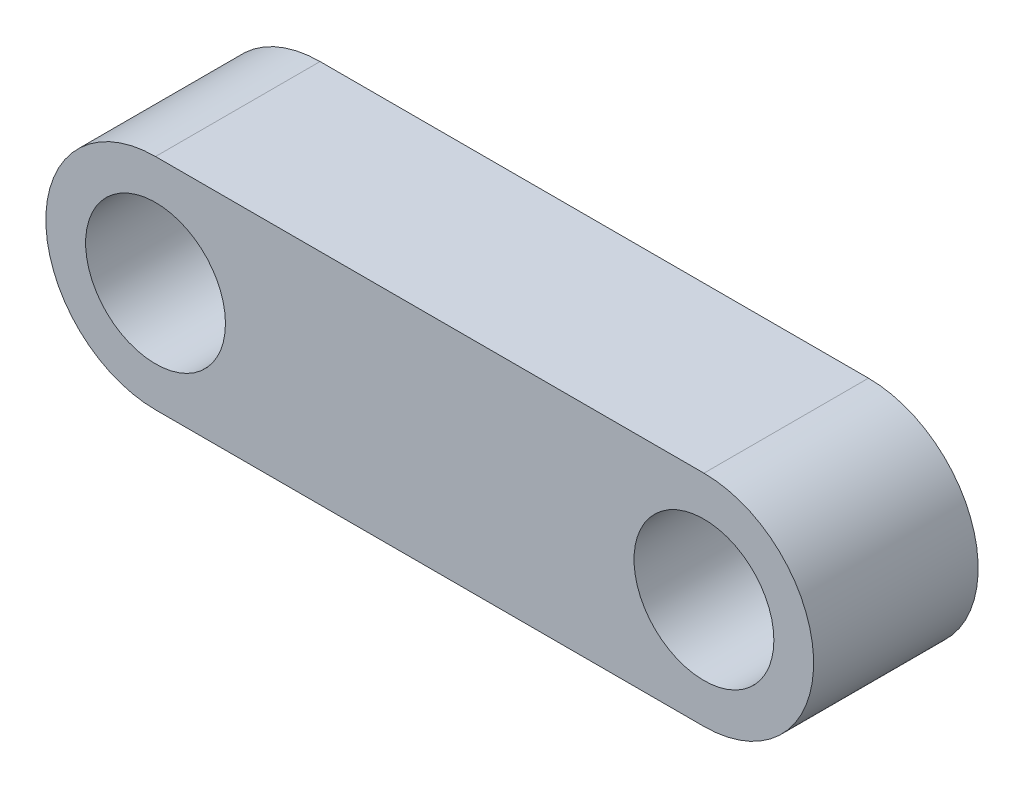
ISO-10303-21;
HEADER;
FILE_DESCRIPTION(('STEP AP214'),'2;1');
FILE_NAME('part.step','',(''),(''),'','','');
FILE_SCHEMA(('AUTOMOTIVE_DESIGN { 1 0 10303 214 1 1 1 1 }'));
ENDSEC;
DATA;
#1=APPLICATION_CONTEXT('core data for automotive mechanical design processes');
#2=APPLICATION_PROTOCOL_DEFINITION('international standard','automotive_design',2000,#1);
#3=PRODUCT_CONTEXT('',#1,'mechanical');
#4=PRODUCT('Part','Part','',(#3));
#5=PRODUCT_RELATED_PRODUCT_CATEGORY('part','',(#4));
#6=PRODUCT_DEFINITION_FORMATION('','',#4);
#7=PRODUCT_DEFINITION_CONTEXT('part definition',#1,'design');
#8=PRODUCT_DEFINITION('design','',#6,#7);
#9=PRODUCT_DEFINITION_SHAPE('','',#8);
#10=(LENGTH_UNIT() NAMED_UNIT(*) SI_UNIT(.MILLI.,.METRE.));
#11=(NAMED_UNIT(*) PLANE_ANGLE_UNIT() SI_UNIT($,.RADIAN.));
#12=(NAMED_UNIT(*) SI_UNIT($,.STERADIAN.) SOLID_ANGLE_UNIT());
#13=UNCERTAINTY_MEASURE_WITH_UNIT(LENGTH_MEASURE(1.E-05),#10,'distance_accuracy_value','');
#14=(GEOMETRIC_REPRESENTATION_CONTEXT(3) GLOBAL_UNCERTAINTY_ASSIGNED_CONTEXT((#13)) GLOBAL_UNIT_ASSIGNED_CONTEXT((#10,
#11,#12)) REPRESENTATION_CONTEXT('',''));
#15=CARTESIAN_POINT('',(0.,0.,0.));
#16=DIRECTION('',(0.,0.,1.));
#17=DIRECTION('',(1.,0.,0.));
#18=AXIS2_PLACEMENT_3D('',#15,#16,#17);
#19=CARTESIAN_POINT('',(10.,0.,6.));
#20=DIRECTION('',(0.,0.,1.));
#21=DIRECTION('',(1.,0.,0.));
#22=AXIS2_PLACEMENT_3D('',#19,#20,#21);
#23=PLANE('',#22);
#24=CARTESIAN_POINT('',(10.,0.,6.));
#25=DIRECTION('',(0.,0.,1.));
#26=DIRECTION('',(1.,0.,0.));
#27=AXIS2_PLACEMENT_3D('',#24,#25,#26);
#28=CIRCLE('',#27,2.55);
#29=CARTESIAN_POINT('',(12.55,0.,6.));
#30=VERTEX_POINT('',#29);
#31=EDGE_CURVE('E102',#30,#30,#28,.T.);
#32=ORIENTED_EDGE('',*,*,#31,.F.);
#33=EDGE_LOOP('',(#32));
#34=FACE_BOUND('',#33,.T.);
#35=CARTESIAN_POINT('',(10.,0.,6.));
#36=DIRECTION('',(0.,0.,1.));
#37=DIRECTION('',(1.,0.,0.));
#38=AXIS2_PLACEMENT_3D('',#35,#36,#37);
#39=CIRCLE('',#38,4.);
#40=CARTESIAN_POINT('',(10.,-4.,6.));
#41=VERTEX_POINT('',#40);
#42=CARTESIAN_POINT('',(10.,4.,6.));
#43=VERTEX_POINT('',#42);
#44=EDGE_CURVE('E85',#41,#43,#39,.T.);
#45=ORIENTED_EDGE('',*,*,#44,.T.);
#46=DIRECTION('',(-1.,0.,0.));
#47=VECTOR('',#46,1.);
#48=CARTESIAN_POINT('',(10.,4.,6.));
#49=LINE('',#48,#47);
#50=CARTESIAN_POINT('',(-10.,3.99999999999999,6.));
#51=VERTEX_POINT('',#50);
#52=EDGE_CURVE('E79',#43,#51,#49,.T.);
#53=ORIENTED_EDGE('',*,*,#52,.T.);
#54=CARTESIAN_POINT('',(-9.99999999999998,0.,6.));
#55=DIRECTION('',(0.,0.,1.));
#56=DIRECTION('',(-1.,0.,0.));
#57=AXIS2_PLACEMENT_3D('',#54,#55,#56);
#58=CIRCLE('',#57,4.);
#59=CARTESIAN_POINT('',(-9.99999999999996,-4.,6.));
#60=VERTEX_POINT('',#59);
#61=EDGE_CURVE('E82',#51,#60,#58,.T.);
#62=ORIENTED_EDGE('',*,*,#61,.T.);
#63=DIRECTION('',(1.,0.,0.));
#64=VECTOR('',#63,1.);
#65=CARTESIAN_POINT('',(5.,-4.,6.));
#66=LINE('',#65,#64);
#67=EDGE_CURVE('E51',#60,#41,#66,.T.);
#68=ORIENTED_EDGE('',*,*,#67,.T.);
#69=EDGE_LOOP('',(#45,#53,#62,#68));
#70=FACE_BOUND('',#69,.T.);
#71=CARTESIAN_POINT('',(-9.99999999999998,0.,6.));
#72=DIRECTION('',(0.,0.,1.));
#73=DIRECTION('',(1.,0.,0.));
#74=AXIS2_PLACEMENT_3D('',#71,#72,#73);
#75=CIRCLE('',#74,2.55000000000001);
#76=CARTESIAN_POINT('',(-7.44999999999997,0.,6.));
#77=VERTEX_POINT('',#76);
#78=EDGE_CURVE('E114',#77,#77,#75,.T.);
#79=ORIENTED_EDGE('',*,*,#78,.F.);
#80=EDGE_LOOP('',(#79));
#81=FACE_BOUND('',#80,.T.);
#82=ADVANCED_FACE('F34',(#34,#70,#81),#23,.T.);
#83=CARTESIAN_POINT('',(10.,0.,0.));
#84=DIRECTION('',(0.,0.,1.));
#85=DIRECTION('',(1.,0.,0.));
#86=AXIS2_PLACEMENT_3D('',#83,#84,#85);
#87=PLANE('',#86);
#88=CARTESIAN_POINT('',(10.,0.,0.));
#89=DIRECTION('',(0.,0.,1.));
#90=DIRECTION('',(1.,0.,0.));
#91=AXIS2_PLACEMENT_3D('',#88,#89,#90);
#92=CIRCLE('',#91,4.);
#93=CARTESIAN_POINT('',(10.,-4.,0.));
#94=VERTEX_POINT('',#93);
#95=CARTESIAN_POINT('',(10.,4.,0.));
#96=VERTEX_POINT('',#95);
#97=EDGE_CURVE('E99',#94,#96,#92,.T.);
#98=ORIENTED_EDGE('',*,*,#97,.F.);
#99=DIRECTION('',(1.,0.,0.));
#100=VECTOR('',#99,1.);
#101=CARTESIAN_POINT('',(10.,-4.,0.));
#102=LINE('',#101,#100);
#103=CARTESIAN_POINT('',(-9.99999999999996,-4.,0.));
#104=VERTEX_POINT('',#103);
#105=EDGE_CURVE('E68',#104,#94,#102,.T.);
#106=ORIENTED_EDGE('',*,*,#105,.F.);
#107=CARTESIAN_POINT('',(-9.99999999999998,0.,0.));
#108=DIRECTION('',(0.,0.,1.));
#109=DIRECTION('',(-1.,0.,0.));
#110=AXIS2_PLACEMENT_3D('',#107,#108,#109);
#111=CIRCLE('',#110,4.);
#112=CARTESIAN_POINT('',(-10.,3.99999999999999,0.));
#113=VERTEX_POINT('',#112);
#114=EDGE_CURVE('E104',#113,#104,#111,.T.);
#115=ORIENTED_EDGE('',*,*,#114,.F.);
#116=DIRECTION('',(-1.,0.,0.));
#117=VECTOR('',#116,1.);
#118=CARTESIAN_POINT('',(10.,4.,0.));
#119=LINE('',#118,#117);
#120=EDGE_CURVE('E90',#96,#113,#119,.T.);
#121=ORIENTED_EDGE('',*,*,#120,.F.);
#122=EDGE_LOOP('',(#98,#106,#115,#121));
#123=FACE_BOUND('',#122,.T.);
#124=CARTESIAN_POINT('',(10.,0.,0.));
#125=DIRECTION('',(0.,0.,1.));
#126=DIRECTION('',(1.,0.,0.));
#127=AXIS2_PLACEMENT_3D('',#124,#125,#126);
#128=CIRCLE('',#127,2.55);
#129=CARTESIAN_POINT('',(12.55,0.,0.));
#130=VERTEX_POINT('',#129);
#131=EDGE_CURVE('E111',#130,#130,#128,.T.);
#132=ORIENTED_EDGE('',*,*,#131,.T.);
#133=EDGE_LOOP('',(#132));
#134=FACE_BOUND('',#133,.T.);
#135=CARTESIAN_POINT('',(-9.99999999999998,0.,0.));
#136=DIRECTION('',(0.,0.,1.));
#137=DIRECTION('',(1.,0.,0.));
#138=AXIS2_PLACEMENT_3D('',#135,#136,#137);
#139=CIRCLE('',#138,2.55000000000001);
#140=CARTESIAN_POINT('',(-7.44999999999997,0.,0.));
#141=VERTEX_POINT('',#140);
#142=EDGE_CURVE('E117',#141,#141,#139,.T.);
#143=ORIENTED_EDGE('',*,*,#142,.T.);
#144=EDGE_LOOP('',(#143));
#145=FACE_BOUND('',#144,.T.);
#146=ADVANCED_FACE('F126',(#123,#134,#145),#87,.F.);
#147=CARTESIAN_POINT('',(10.,0.,6.));
#148=DIRECTION('',(0.,0.,-1.));
#149=DIRECTION('',(-1.,0.,0.));
#150=AXIS2_PLACEMENT_3D('',#147,#148,#149);
#151=CYLINDRICAL_SURFACE('',#150,4.);
#152=ORIENTED_EDGE('',*,*,#97,.T.);
#153=DIRECTION('',(0.,0.,-1.));
#154=VECTOR('',#153,1.);
#155=CARTESIAN_POINT('',(10.,4.,6.));
#156=LINE('',#155,#154);
#157=EDGE_CURVE('E11',#43,#96,#156,.T.);
#158=ORIENTED_EDGE('',*,*,#157,.F.);
#159=ORIENTED_EDGE('',*,*,#44,.F.);
#160=DIRECTION('',(0.,0.,-1.));
#161=VECTOR('',#160,1.);
#162=CARTESIAN_POINT('',(10.,-4.,6.));
#163=LINE('',#162,#161);
#164=EDGE_CURVE('E95',#41,#94,#163,.T.);
#165=ORIENTED_EDGE('',*,*,#164,.T.);
#166=EDGE_LOOP('',(#152,#158,#159,#165));
#167=FACE_BOUND('',#166,.T.);
#168=ADVANCED_FACE('F36',(#167),#151,.T.);
#169=CARTESIAN_POINT('',(10.,4.,6.));
#170=DIRECTION('',(0.,-1.,0.));
#171=DIRECTION('',(1.,0.,0.));
#172=AXIS2_PLACEMENT_3D('',#169,#170,#171);
#173=PLANE('',#172);
#174=ORIENTED_EDGE('',*,*,#120,.T.);
#175=DIRECTION('',(0.,0.,-1.));
#176=VECTOR('',#175,1.);
#177=CARTESIAN_POINT('',(-10.,3.99999999999999,6.));
#178=LINE('',#177,#176);
#179=EDGE_CURVE('E43',#51,#113,#178,.T.);
#180=ORIENTED_EDGE('',*,*,#179,.F.);
#181=ORIENTED_EDGE('',*,*,#52,.F.);
#182=ORIENTED_EDGE('',*,*,#157,.T.);
#183=EDGE_LOOP('',(#174,#180,#181,#182));
#184=FACE_BOUND('',#183,.T.);
#185=ADVANCED_FACE('F89',(#184),#173,.F.);
#186=CARTESIAN_POINT('',(-9.99999999999998,0.,6.));
#187=DIRECTION('',(0.,0.,-1.));
#188=DIRECTION('',(-1.,0.,0.));
#189=AXIS2_PLACEMENT_3D('',#186,#187,#188);
#190=CYLINDRICAL_SURFACE('',#189,4.);
#191=ORIENTED_EDGE('',*,*,#114,.T.);
#192=DIRECTION('',(0.,0.,-1.));
#193=VECTOR('',#192,1.);
#194=CARTESIAN_POINT('',(-9.99999999999996,-4.,6.));
#195=LINE('',#194,#193);
#196=EDGE_CURVE('E92',#60,#104,#195,.T.);
#197=ORIENTED_EDGE('',*,*,#196,.F.);
#198=ORIENTED_EDGE('',*,*,#61,.F.);
#199=ORIENTED_EDGE('',*,*,#179,.T.);
#200=EDGE_LOOP('',(#191,#197,#198,#199));
#201=FACE_BOUND('',#200,.T.);
#202=ADVANCED_FACE('F93',(#201),#190,.T.);
#203=CARTESIAN_POINT('',(10.,-4.,6.));
#204=DIRECTION('',(0.,1.,0.));
#205=DIRECTION('',(0.,0.,1.));
#206=AXIS2_PLACEMENT_3D('',#203,#204,#205);
#207=PLANE('',#206);
#208=ORIENTED_EDGE('',*,*,#105,.T.);
#209=ORIENTED_EDGE('',*,*,#164,.F.);
#210=ORIENTED_EDGE('',*,*,#67,.F.);
#211=ORIENTED_EDGE('',*,*,#196,.T.);
#212=EDGE_LOOP('',(#208,#209,#210,#211));
#213=FACE_BOUND('',#212,.T.);
#214=ADVANCED_FACE('F108',(#213),#207,.F.);
#215=CARTESIAN_POINT('',(10.,0.,6.));
#216=DIRECTION('',(0.,0.,-1.));
#217=DIRECTION('',(-1.,0.,0.));
#218=AXIS2_PLACEMENT_3D('',#215,#216,#217);
#219=CYLINDRICAL_SURFACE('',#218,2.55);
#220=ORIENTED_EDGE('',*,*,#31,.T.);
#221=EDGE_LOOP('',(#220));
#222=FACE_BOUND('',#221,.T.);
#223=ORIENTED_EDGE('',*,*,#131,.F.);
#224=EDGE_LOOP('',(#223));
#225=FACE_BOUND('',#224,.T.);
#226=ADVANCED_FACE('F135',(#222,#225),#219,.F.);
#227=CARTESIAN_POINT('',(-9.99999999999998,0.,6.));
#228=DIRECTION('',(0.,0.,-1.));
#229=DIRECTION('',(-1.,0.,0.));
#230=AXIS2_PLACEMENT_3D('',#227,#228,#229);
#231=CYLINDRICAL_SURFACE('',#230,2.55000000000001);
#232=ORIENTED_EDGE('',*,*,#78,.T.);
#233=EDGE_LOOP('',(#232));
#234=FACE_BOUND('',#233,.T.);
#235=ORIENTED_EDGE('',*,*,#142,.F.);
#236=EDGE_LOOP('',(#235));
#237=FACE_BOUND('',#236,.T.);
#238=ADVANCED_FACE('F123',(#234,#237),#231,.F.);
#239=CLOSED_SHELL('',(#82,#146,#168,#185,#202,#214,#226,#238));
#240=MANIFOLD_SOLID_BREP('B2',#239);
#241=ADVANCED_BREP_SHAPE_REPRESENTATION('',(#18,#240),#14);
#242=SHAPE_DEFINITION_REPRESENTATION(#9,#241);
ENDSEC;
END-ISO-10303-21;
